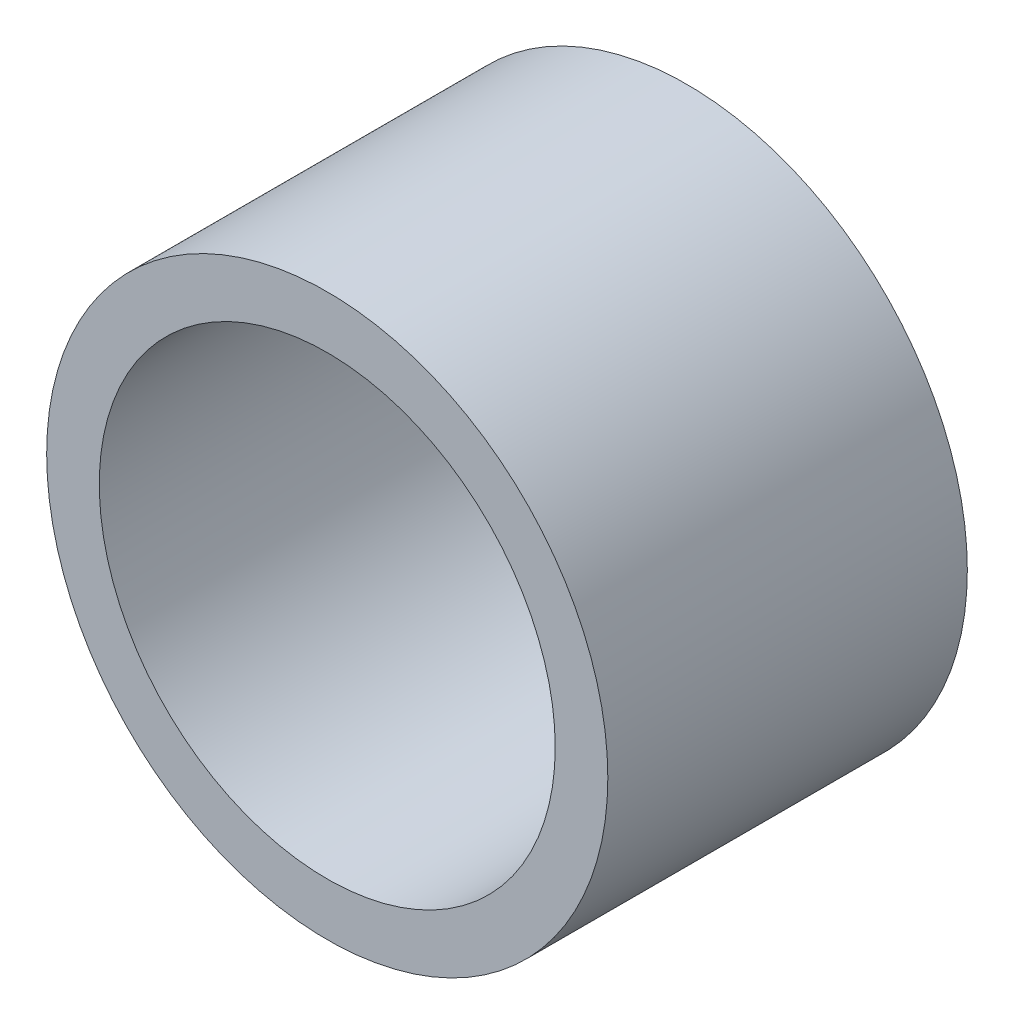
ISO-10303-21;
HEADER;
FILE_DESCRIPTION(('STEP AP214'),'2;1');
FILE_NAME('part.step','',(''),(''),'','','');
FILE_SCHEMA(('AUTOMOTIVE_DESIGN { 1 0 10303 214 1 1 1 1 }'));
ENDSEC;
DATA;
#1=APPLICATION_CONTEXT('core data for automotive mechanical design processes');
#2=APPLICATION_PROTOCOL_DEFINITION('international standard','automotive_design',2000,#1);
#3=PRODUCT_CONTEXT('',#1,'mechanical');
#4=PRODUCT('Part','Part','',(#3));
#5=PRODUCT_RELATED_PRODUCT_CATEGORY('part','',(#4));
#6=PRODUCT_DEFINITION_FORMATION('','',#4);
#7=PRODUCT_DEFINITION_CONTEXT('part definition',#1,'design');
#8=PRODUCT_DEFINITION('design','',#6,#7);
#9=PRODUCT_DEFINITION_SHAPE('','',#8);
#10=(LENGTH_UNIT() NAMED_UNIT(*) SI_UNIT(.MILLI.,.METRE.));
#11=(NAMED_UNIT(*) PLANE_ANGLE_UNIT() SI_UNIT($,.RADIAN.));
#12=(NAMED_UNIT(*) SI_UNIT($,.STERADIAN.) SOLID_ANGLE_UNIT());
#13=UNCERTAINTY_MEASURE_WITH_UNIT(LENGTH_MEASURE(1.E-05),#10,'distance_accuracy_value','');
#14=(GEOMETRIC_REPRESENTATION_CONTEXT(3) GLOBAL_UNCERTAINTY_ASSIGNED_CONTEXT((#13)) GLOBAL_UNIT_ASSIGNED_CONTEXT((#10,
#11,#12)) REPRESENTATION_CONTEXT('',''));
#15=CARTESIAN_POINT('',(0.,0.,0.));
#16=DIRECTION('',(0.,0.,1.));
#17=DIRECTION('',(1.,0.,0.));
#18=AXIS2_PLACEMENT_3D('',#15,#16,#17);
#19=CARTESIAN_POINT('',(0.,0.,20.5000000000002));
#20=DIRECTION('',(0.,0.,1.));
#21=DIRECTION('',(1.,0.,0.));
#22=AXIS2_PLACEMENT_3D('',#19,#20,#21);
#23=PLANE('',#22);
#24=CARTESIAN_POINT('',(0.,0.,20.5000000000002));
#25=DIRECTION('',(0.,0.,1.));
#26=DIRECTION('',(1.,0.,0.));
#27=AXIS2_PLACEMENT_3D('',#24,#25,#26);
#28=CIRCLE('',#27,16.);
#29=CARTESIAN_POINT('',(16.,0.,20.5000000000002));
#30=VERTEX_POINT('',#29);
#31=EDGE_CURVE('E10',#30,#30,#28,.T.);
#32=ORIENTED_EDGE('',*,*,#31,.T.);
#33=EDGE_LOOP('',(#32));
#34=FACE_BOUND('',#33,.T.);
#35=CARTESIAN_POINT('',(0.,0.,20.5000000000002));
#36=DIRECTION('',(0.,0.,1.));
#37=DIRECTION('',(1.,0.,0.));
#38=AXIS2_PLACEMENT_3D('',#35,#36,#37);
#39=CIRCLE('',#38,13.);
#40=CARTESIAN_POINT('',(13.,0.,20.5000000000002));
#41=VERTEX_POINT('',#40);
#42=EDGE_CURVE('E41',#41,#41,#39,.T.);
#43=ORIENTED_EDGE('',*,*,#42,.F.);
#44=EDGE_LOOP('',(#43));
#45=FACE_BOUND('',#44,.T.);
#46=ADVANCED_FACE('F30',(#34,#45),#23,.T.);
#47=CARTESIAN_POINT('',(0.,0.,0.));
#48=DIRECTION('',(0.,0.,1.));
#49=DIRECTION('',(1.,0.,0.));
#50=AXIS2_PLACEMENT_3D('',#47,#48,#49);
#51=PLANE('',#50);
#52=CARTESIAN_POINT('',(0.,0.,0.));
#53=DIRECTION('',(0.,0.,1.));
#54=DIRECTION('',(1.,0.,0.));
#55=AXIS2_PLACEMENT_3D('',#52,#53,#54);
#56=CIRCLE('',#55,16.);
#57=CARTESIAN_POINT('',(16.,0.,0.));
#58=VERTEX_POINT('',#57);
#59=EDGE_CURVE('E34',#58,#58,#56,.T.);
#60=ORIENTED_EDGE('',*,*,#59,.F.);
#61=EDGE_LOOP('',(#60));
#62=FACE_BOUND('',#61,.T.);
#63=CARTESIAN_POINT('',(0.,0.,0.));
#64=DIRECTION('',(0.,0.,1.));
#65=DIRECTION('',(1.,0.,0.));
#66=AXIS2_PLACEMENT_3D('',#63,#64,#65);
#67=CIRCLE('',#66,13.);
#68=CARTESIAN_POINT('',(13.,0.,0.));
#69=VERTEX_POINT('',#68);
#70=EDGE_CURVE('E43',#69,#69,#67,.T.);
#71=ORIENTED_EDGE('',*,*,#70,.T.);
#72=EDGE_LOOP('',(#71));
#73=FACE_BOUND('',#72,.T.);
#74=ADVANCED_FACE('F53',(#62,#73),#51,.F.);
#75=CARTESIAN_POINT('',(0.,0.,20.5000000000002));
#76=DIRECTION('',(0.,0.,-1.));
#77=DIRECTION('',(-1.,0.,0.));
#78=AXIS2_PLACEMENT_3D('',#75,#76,#77);
#79=CYLINDRICAL_SURFACE('',#78,16.);
#80=ORIENTED_EDGE('',*,*,#31,.F.);
#81=EDGE_LOOP('',(#80));
#82=FACE_BOUND('',#81,.T.);
#83=ORIENTED_EDGE('',*,*,#59,.T.);
#84=EDGE_LOOP('',(#83));
#85=FACE_BOUND('',#84,.T.);
#86=ADVANCED_FACE('F32',(#82,#85),#79,.T.);
#87=CARTESIAN_POINT('',(0.,0.,20.5000000000002));
#88=DIRECTION('',(0.,0.,-1.));
#89=DIRECTION('',(-1.,0.,0.));
#90=AXIS2_PLACEMENT_3D('',#87,#88,#89);
#91=CYLINDRICAL_SURFACE('',#90,13.);
#92=ORIENTED_EDGE('',*,*,#42,.T.);
#93=EDGE_LOOP('',(#92));
#94=FACE_BOUND('',#93,.T.);
#95=ORIENTED_EDGE('',*,*,#70,.F.);
#96=EDGE_LOOP('',(#95));
#97=FACE_BOUND('',#96,.T.);
#98=ADVANCED_FACE('F49',(#94,#97),#91,.F.);
#99=CLOSED_SHELL('',(#46,#74,#86,#98));
#100=MANIFOLD_SOLID_BREP('B2',#99);
#101=ADVANCED_BREP_SHAPE_REPRESENTATION('',(#18,#100),#14);
#102=SHAPE_DEFINITION_REPRESENTATION(#9,#101);
ENDSEC;
END-ISO-10303-21;
